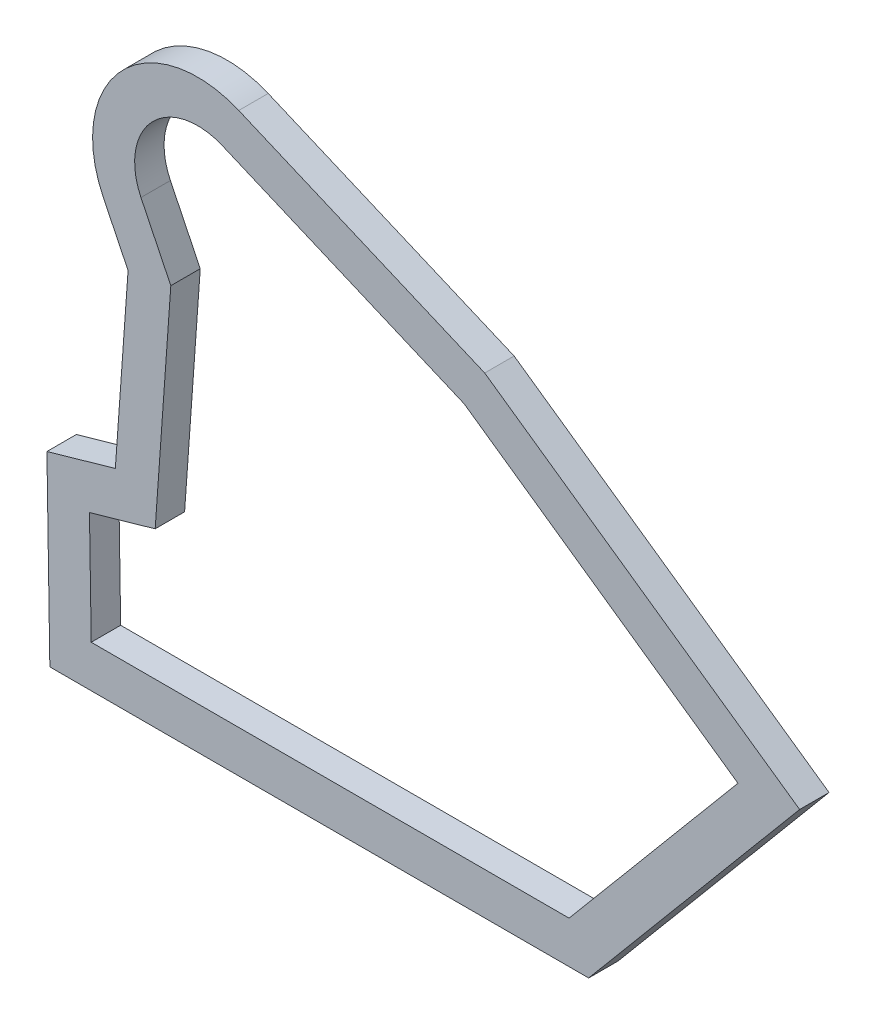
ISO-10303-21;
HEADER;
FILE_DESCRIPTION(('STEP AP214'),'2;1');
FILE_NAME('part.step','',(''),(''),'','','');
FILE_SCHEMA(('AUTOMOTIVE_DESIGN { 1 0 10303 214 1 1 1 1 }'));
ENDSEC;
DATA;
#1=APPLICATION_CONTEXT('core data for automotive mechanical design processes');
#2=APPLICATION_PROTOCOL_DEFINITION('international standard','automotive_design',2000,#1);
#3=PRODUCT_CONTEXT('',#1,'mechanical');
#4=PRODUCT('Part','Part','',(#3));
#5=PRODUCT_RELATED_PRODUCT_CATEGORY('part','',(#4));
#6=PRODUCT_DEFINITION_FORMATION('','',#4);
#7=PRODUCT_DEFINITION_CONTEXT('part definition',#1,'design');
#8=PRODUCT_DEFINITION('design','',#6,#7);
#9=PRODUCT_DEFINITION_SHAPE('','',#8);
#10=(LENGTH_UNIT() NAMED_UNIT(*) SI_UNIT(.MILLI.,.METRE.));
#11=(NAMED_UNIT(*) PLANE_ANGLE_UNIT() SI_UNIT($,.RADIAN.));
#12=(NAMED_UNIT(*) SI_UNIT($,.STERADIAN.) SOLID_ANGLE_UNIT());
#13=UNCERTAINTY_MEASURE_WITH_UNIT(LENGTH_MEASURE(1.E-05),#10,'distance_accuracy_value','');
#14=(GEOMETRIC_REPRESENTATION_CONTEXT(3) GLOBAL_UNCERTAINTY_ASSIGNED_CONTEXT((#13)) GLOBAL_UNIT_ASSIGNED_CONTEXT((#10,
#11,#12)) REPRESENTATION_CONTEXT('',''));
#15=CARTESIAN_POINT('',(0.,0.,0.));
#16=DIRECTION('',(0.,0.,1.));
#17=DIRECTION('',(1.,0.,0.));
#18=AXIS2_PLACEMENT_3D('',#15,#16,#17);
#19=CARTESIAN_POINT('',(18.1303757080204,56.6360908454548,2.8));
#20=DIRECTION('',(0.,0.,1.));
#21=DIRECTION('',(1.,0.,0.));
#22=AXIS2_PLACEMENT_3D('',#19,#20,#21);
#23=PLANE('',#22);
#24=CARTESIAN_POINT('',(18.1303757080204,56.6360908454548,2.8));
#25=DIRECTION('',(0.,0.,1.));
#26=DIRECTION('',(1.,0.,0.));
#27=AXIS2_PLACEMENT_3D('',#24,#25,#26);
#28=CIRCLE('',#27,10.);
#29=CARTESIAN_POINT('',(22.0376869929131,65.8411393799792,2.8));
#30=VERTEX_POINT('',#29);
#31=CARTESIAN_POINT('',(9.13500430810876,52.2676479446431,2.8));
#32=VERTEX_POINT('',#31);
#33=EDGE_CURVE('E266',#30,#32,#28,.T.);
#34=ORIENTED_EDGE('',*,*,#33,.T.);
#35=DIRECTION('',(0.436844290081168,-0.899537139991163,0.));
#36=VECTOR('',#35,1.);
#37=CARTESIAN_POINT('',(11.5062838946548,47.3847775355903,2.8));
#38=LINE('',#37,#36);
#39=CARTESIAN_POINT('',(11.5062838946548,47.3847775355903,2.8));
#40=VERTEX_POINT('',#39);
#41=EDGE_CURVE('E270',#32,#40,#38,.T.);
#42=ORIENTED_EDGE('',*,*,#41,.T.);
#43=DIRECTION('',(-0.0714503172871127,-0.99744415992053,0.));
#44=VECTOR('',#43,1.);
#45=CARTESIAN_POINT('',(10.2944473934542,30.4675784692252,2.8));
#46=LINE('',#45,#44);
#47=CARTESIAN_POINT('',(10.2944473934542,30.4675784692252,2.8));
#48=VERTEX_POINT('',#47);
#49=EDGE_CURVE('E274',#40,#48,#46,.T.);
#50=ORIENTED_EDGE('',*,*,#49,.T.);
#51=DIRECTION('',(-0.961728364482525,-0.274004658627856,0.));
#52=VECTOR('',#51,1.);
#53=CARTESIAN_POINT('',(3.7850103097116,28.6129840204588,2.8));
#54=LINE('',#53,#52);
#55=CARTESIAN_POINT('',(3.7850103097116,28.6129840204588,2.8));
#56=VERTEX_POINT('',#55);
#57=EDGE_CURVE('E277',#48,#56,#54,.T.);
#58=ORIENTED_EDGE('',*,*,#57,.T.);
#59=DIRECTION('',(0.0157545593487914,-0.999875889228121,0.));
#60=VECTOR('',#59,1.);
#61=CARTESIAN_POINT('',(4.06252955489897,11.,2.8));
#62=LINE('',#61,#60);
#63=CARTESIAN_POINT('',(4.06252955489897,11.,2.8));
#64=VERTEX_POINT('',#63);
#65=EDGE_CURVE('E280',#56,#64,#62,.T.);
#66=ORIENTED_EDGE('',*,*,#65,.T.);
#67=DIRECTION('',(1.,0.,0.));
#68=VECTOR('',#67,1.);
#69=CARTESIAN_POINT('',(55.3319592141137,11.,2.8));
#70=LINE('',#69,#68);
#71=CARTESIAN_POINT('',(55.3319592141137,11.,2.8));
#72=VERTEX_POINT('',#71);
#73=EDGE_CURVE('E283',#64,#72,#70,.T.);
#74=ORIENTED_EDGE('',*,*,#73,.T.);
#75=DIRECTION('',(0.642787609686537,0.76604444311898,0.));
#76=VECTOR('',#75,1.);
#77=CARTESIAN_POINT('',(75.4065149274647,34.9239238911188,2.8));
#78=LINE('',#77,#76);
#79=CARTESIAN_POINT('',(75.4065149274647,34.9239238911188,2.8));
#80=VERTEX_POINT('',#79);
#81=EDGE_CURVE('E286',#72,#80,#78,.T.);
#82=ORIENTED_EDGE('',*,*,#81,.T.);
#83=DIRECTION('',(-0.819152044288996,0.573576436351041,0.));
#84=VECTOR('',#83,1.);
#85=CARTESIAN_POINT('',(45.437304163946,55.9085911819299,2.8));
#86=LINE('',#85,#84);
#87=CARTESIAN_POINT('',(45.437304163946,55.9085911819299,2.8));
#88=VERTEX_POINT('',#87);
#89=EDGE_CURVE('E289',#80,#88,#86,.T.);
#90=ORIENTED_EDGE('',*,*,#89,.T.);
#91=DIRECTION('',(-0.92050485345244,0.390731128489274,0.));
#92=VECTOR('',#91,1.);
#93=CARTESIAN_POINT('',(22.0376869929131,65.8411393799792,2.8));
#94=LINE('',#93,#92);
#95=EDGE_CURVE('E292',#88,#30,#94,.T.);
#96=ORIENTED_EDGE('',*,*,#95,.T.);
#97=EDGE_LOOP('',(#34,#42,#50,#58,#66,#74,#82,#90,#96));
#98=FACE_BOUND('',#97,.T.);
#99=CARTESIAN_POINT('',(18.1303757080204,56.6360908454548,2.8));
#100=DIRECTION('',(0.,0.,1.));
#101=DIRECTION('',(1.,0.,0.));
#102=AXIS2_PLACEMENT_3D('',#99,#100,#101);
#103=CIRCLE('',#102,5.99999999999999);
#104=CARTESIAN_POINT('',(20.474762478956,62.1591199661694,2.8));
#105=VERTEX_POINT('',#104);
#106=CARTESIAN_POINT('',(12.7331528680734,54.0150251049678,2.8));
#107=VERTEX_POINT('',#106);
#108=EDGE_CURVE('E176',#105,#107,#103,.T.);
#109=ORIENTED_EDGE('',*,*,#108,.F.);
#110=DIRECTION('',(-0.92050485345244,0.390731128489273,0.));
#111=VECTOR('',#110,1.);
#112=CARTESIAN_POINT('',(43.487383815267,52.3908417539376,2.8));
#113=LINE('',#112,#111);
#114=CARTESIAN_POINT('',(43.487383815267,52.3908417539376,2.8));
#115=VERTEX_POINT('',#114);
#116=EDGE_CURVE('E167',#115,#105,#113,.T.);
#117=ORIENTED_EDGE('',*,*,#116,.F.);
#118=DIRECTION('',(-0.819152044288995,0.573576436351041,0.));
#119=VECTOR('',#118,1.);
#120=CARTESIAN_POINT('',(43.487383815267,52.3908417539376,2.8));
#121=LINE('',#120,#119);
#122=CARTESIAN_POINT('',(69.5364188236571,34.1511110779745,2.8));
#123=VERTEX_POINT('',#122);
#124=EDGE_CURVE('E211',#123,#115,#121,.T.);
#125=ORIENTED_EDGE('',*,*,#124,.F.);
#126=DIRECTION('',(0.642787609686537,0.76604444311898,0.));
#127=VECTOR('',#126,1.);
#128=CARTESIAN_POINT('',(69.5364188236571,34.1511110779745,2.8));
#129=LINE('',#128,#127);
#130=CARTESIAN_POINT('',(53.4667285814937,15.,2.8));
#131=VERTEX_POINT('',#130);
#132=EDGE_CURVE('E208',#131,#123,#129,.T.);
#133=ORIENTED_EDGE('',*,*,#132,.F.);
#134=DIRECTION('',(1.,0.,0.));
#135=VECTOR('',#134,1.);
#136=CARTESIAN_POINT('',(53.4667285814937,15.,2.8));
#137=LINE('',#136,#135);
#138=CARTESIAN_POINT('',(8.,15.,2.8));
#139=VERTEX_POINT('',#138);
#140=EDGE_CURVE('E205',#139,#131,#137,.T.);
#141=ORIENTED_EDGE('',*,*,#140,.F.);
#142=DIRECTION('',(0.0157545593487913,-0.999875889228121,0.));
#143=VECTOR('',#142,1.);
#144=CARTESIAN_POINT('',(8.,15.,2.8));
#145=LINE('',#144,#143);
#146=CARTESIAN_POINT('',(7.83286946091226,25.6070752401172,2.8));
#147=VERTEX_POINT('',#146);
#148=EDGE_CURVE('E202',#147,#139,#145,.T.);
#149=ORIENTED_EDGE('',*,*,#148,.F.);
#150=DIRECTION('',(-0.961728364482525,-0.274004658627856,0.));
#151=VECTOR('',#150,1.);
#152=CARTESIAN_POINT('',(7.83286946091226,25.6070752401172,2.8));
#153=LINE('',#152,#151);
#154=CARTESIAN_POINT('',(14.0841038300487,27.3881055211983,2.8));
#155=VERTEX_POINT('',#154);
#156=EDGE_CURVE('E199',#155,#147,#153,.T.);
#157=ORIENTED_EDGE('',*,*,#156,.F.);
#158=DIRECTION('',(-0.0714503172871127,-0.99744415992053,0.));
#159=VECTOR('',#158,1.);
#160=CARTESIAN_POINT('',(14.0841038300487,27.3881055211983,2.8));
#161=LINE('',#160,#159);
#162=CARTESIAN_POINT('',(15.572640753601,48.1680336950252,2.8));
#163=VERTEX_POINT('',#162);
#164=EDGE_CURVE('E194',#163,#155,#161,.T.);
#165=ORIENTED_EDGE('',*,*,#164,.F.);
#166=DIRECTION('',(0.436844290081168,-0.899537139991162,0.));
#167=VECTOR('',#166,1.);
#168=CARTESIAN_POINT('',(15.572640753601,48.1680336950252,2.8));
#169=LINE('',#168,#167);
#170=EDGE_CURVE('E190',#107,#163,#169,.T.);
#171=ORIENTED_EDGE('',*,*,#170,.F.);
#172=EDGE_LOOP('',(#109,#117,#125,#133,#141,#149,#157,#165,#171));
#173=FACE_BOUND('',#172,.T.);
#174=ADVANCED_FACE('F41',(#98,#173),#23,.T.);
#175=CARTESIAN_POINT('',(18.1303757080204,56.6360908454548,0.));
#176=DIRECTION('',(0.,0.,1.));
#177=DIRECTION('',(1.,0.,0.));
#178=AXIS2_PLACEMENT_3D('',#175,#176,#177);
#179=PLANE('',#178);
#180=CARTESIAN_POINT('',(18.1303757080204,56.6360908454548,0.));
#181=DIRECTION('',(0.,0.,1.));
#182=DIRECTION('',(1.,0.,0.));
#183=AXIS2_PLACEMENT_3D('',#180,#181,#182);
#184=CIRCLE('',#183,10.);
#185=CARTESIAN_POINT('',(22.0376869929131,65.8411393799792,0.));
#186=VERTEX_POINT('',#185);
#187=CARTESIAN_POINT('',(9.13500430810876,52.2676479446431,0.));
#188=VERTEX_POINT('',#187);
#189=EDGE_CURVE('E185',#186,#188,#184,.T.);
#190=ORIENTED_EDGE('',*,*,#189,.F.);
#191=DIRECTION('',(-0.92050485345244,0.390731128489274,0.));
#192=VECTOR('',#191,1.);
#193=CARTESIAN_POINT('',(22.0376869929131,65.8411393799792,0.));
#194=LINE('',#193,#192);
#195=CARTESIAN_POINT('',(45.437304163946,55.9085911819299,0.));
#196=VERTEX_POINT('',#195);
#197=EDGE_CURVE('E271',#196,#186,#194,.T.);
#198=ORIENTED_EDGE('',*,*,#197,.F.);
#199=DIRECTION('',(-0.819152044288996,0.573576436351041,0.));
#200=VECTOR('',#199,1.);
#201=CARTESIAN_POINT('',(45.437304163946,55.9085911819299,0.));
#202=LINE('',#201,#200);
#203=CARTESIAN_POINT('',(75.4065149274647,34.9239238911188,0.));
#204=VERTEX_POINT('',#203);
#205=EDGE_CURVE('E317',#204,#196,#202,.T.);
#206=ORIENTED_EDGE('',*,*,#205,.F.);
#207=DIRECTION('',(0.642787609686537,0.76604444311898,0.));
#208=VECTOR('',#207,1.);
#209=CARTESIAN_POINT('',(75.4065149274647,34.9239238911188,0.));
#210=LINE('',#209,#208);
#211=CARTESIAN_POINT('',(55.3319592141137,11.,0.));
#212=VERTEX_POINT('',#211);
#213=EDGE_CURVE('E314',#212,#204,#210,.T.);
#214=ORIENTED_EDGE('',*,*,#213,.F.);
#215=DIRECTION('',(1.,0.,0.));
#216=VECTOR('',#215,1.);
#217=CARTESIAN_POINT('',(55.3319592141137,11.,0.));
#218=LINE('',#217,#216);
#219=CARTESIAN_POINT('',(4.06252955489897,11.,0.));
#220=VERTEX_POINT('',#219);
#221=EDGE_CURVE('E311',#220,#212,#218,.T.);
#222=ORIENTED_EDGE('',*,*,#221,.F.);
#223=DIRECTION('',(0.0157545593487914,-0.999875889228121,0.));
#224=VECTOR('',#223,1.);
#225=CARTESIAN_POINT('',(4.06252955489897,11.,0.));
#226=LINE('',#225,#224);
#227=CARTESIAN_POINT('',(3.7850103097116,28.6129840204588,0.));
#228=VERTEX_POINT('',#227);
#229=EDGE_CURVE('E308',#228,#220,#226,.T.);
#230=ORIENTED_EDGE('',*,*,#229,.F.);
#231=DIRECTION('',(-0.961728364482525,-0.274004658627856,0.));
#232=VECTOR('',#231,1.);
#233=CARTESIAN_POINT('',(3.7850103097116,28.6129840204588,0.));
#234=LINE('',#233,#232);
#235=CARTESIAN_POINT('',(10.2944473934542,30.4675784692252,0.));
#236=VERTEX_POINT('',#235);
#237=EDGE_CURVE('E305',#236,#228,#234,.T.);
#238=ORIENTED_EDGE('',*,*,#237,.F.);
#239=DIRECTION('',(-0.0714503172871127,-0.99744415992053,0.));
#240=VECTOR('',#239,1.);
#241=CARTESIAN_POINT('',(10.2944473934542,30.4675784692252,0.));
#242=LINE('',#241,#240);
#243=CARTESIAN_POINT('',(11.5062838946548,47.3847775355903,0.));
#244=VERTEX_POINT('',#243);
#245=EDGE_CURVE('E302',#244,#236,#242,.T.);
#246=ORIENTED_EDGE('',*,*,#245,.F.);
#247=DIRECTION('',(0.436844290081168,-0.899537139991163,0.));
#248=VECTOR('',#247,1.);
#249=CARTESIAN_POINT('',(11.5062838946548,47.3847775355903,0.));
#250=LINE('',#249,#248);
#251=EDGE_CURVE('E299',#188,#244,#250,.T.);
#252=ORIENTED_EDGE('',*,*,#251,.F.);
#253=EDGE_LOOP('',(#190,#198,#206,#214,#222,#230,#238,#246,#252));
#254=FACE_BOUND('',#253,.T.);
#255=DIRECTION('',(-0.92050485345244,0.390731128489273,0.));
#256=VECTOR('',#255,1.);
#257=CARTESIAN_POINT('',(43.487383815267,52.3908417539376,0.));
#258=LINE('',#257,#256);
#259=CARTESIAN_POINT('',(43.487383815267,52.3908417539376,0.));
#260=VERTEX_POINT('',#259);
#261=CARTESIAN_POINT('',(20.474762478956,62.1591199661694,0.));
#262=VERTEX_POINT('',#261);
#263=EDGE_CURVE('E65',#260,#262,#258,.T.);
#264=ORIENTED_EDGE('',*,*,#263,.T.);
#265=CARTESIAN_POINT('',(18.1303757080204,56.6360908454548,0.));
#266=DIRECTION('',(0.,0.,1.));
#267=DIRECTION('',(1.,0.,0.));
#268=AXIS2_PLACEMENT_3D('',#265,#266,#267);
#269=CIRCLE('',#268,5.99999999999999);
#270=CARTESIAN_POINT('',(12.7331528680734,54.0150251049678,0.));
#271=VERTEX_POINT('',#270);
#272=EDGE_CURVE('E183',#262,#271,#269,.T.);
#273=ORIENTED_EDGE('',*,*,#272,.T.);
#274=DIRECTION('',(0.436844290081168,-0.899537139991162,0.));
#275=VECTOR('',#274,1.);
#276=CARTESIAN_POINT('',(15.572640753601,48.1680336950252,0.));
#277=LINE('',#276,#275);
#278=CARTESIAN_POINT('',(15.572640753601,48.1680336950252,0.));
#279=VERTEX_POINT('',#278);
#280=EDGE_CURVE('E218',#271,#279,#277,.T.);
#281=ORIENTED_EDGE('',*,*,#280,.T.);
#282=DIRECTION('',(-0.0714503172871127,-0.99744415992053,0.));
#283=VECTOR('',#282,1.);
#284=CARTESIAN_POINT('',(14.0841038300487,27.3881055211983,0.));
#285=LINE('',#284,#283);
#286=CARTESIAN_POINT('',(14.0841038300487,27.3881055211983,0.));
#287=VERTEX_POINT('',#286);
#288=EDGE_CURVE('E222',#279,#287,#285,.T.);
#289=ORIENTED_EDGE('',*,*,#288,.T.);
#290=DIRECTION('',(-0.961728364482525,-0.274004658627856,0.));
#291=VECTOR('',#290,1.);
#292=CARTESIAN_POINT('',(7.83286946091226,25.6070752401172,0.));
#293=LINE('',#292,#291);
#294=CARTESIAN_POINT('',(7.83286946091226,25.6070752401172,0.));
#295=VERTEX_POINT('',#294);
#296=EDGE_CURVE('E226',#287,#295,#293,.T.);
#297=ORIENTED_EDGE('',*,*,#296,.T.);
#298=DIRECTION('',(0.0157545593487913,-0.999875889228121,0.));
#299=VECTOR('',#298,1.);
#300=CARTESIAN_POINT('',(8.,15.,0.));
#301=LINE('',#300,#299);
#302=CARTESIAN_POINT('',(8.,15.,0.));
#303=VERTEX_POINT('',#302);
#304=EDGE_CURVE('E230',#295,#303,#301,.T.);
#305=ORIENTED_EDGE('',*,*,#304,.T.);
#306=DIRECTION('',(1.,0.,0.));
#307=VECTOR('',#306,1.);
#308=CARTESIAN_POINT('',(53.4667285814937,15.,0.));
#309=LINE('',#308,#307);
#310=CARTESIAN_POINT('',(53.4667285814937,15.,0.));
#311=VERTEX_POINT('',#310);
#312=EDGE_CURVE('E234',#303,#311,#309,.T.);
#313=ORIENTED_EDGE('',*,*,#312,.T.);
#314=DIRECTION('',(0.642787609686537,0.76604444311898,0.));
#315=VECTOR('',#314,1.);
#316=CARTESIAN_POINT('',(69.5364188236571,34.1511110779745,0.));
#317=LINE('',#316,#315);
#318=CARTESIAN_POINT('',(69.5364188236571,34.1511110779745,0.));
#319=VERTEX_POINT('',#318);
#320=EDGE_CURVE('E238',#311,#319,#317,.T.);
#321=ORIENTED_EDGE('',*,*,#320,.T.);
#322=DIRECTION('',(-0.819152044288995,0.573576436351041,0.));
#323=VECTOR('',#322,1.);
#324=CARTESIAN_POINT('',(43.487383815267,52.3908417539376,0.));
#325=LINE('',#324,#323);
#326=EDGE_CURVE('E177',#319,#260,#325,.T.);
#327=ORIENTED_EDGE('',*,*,#326,.T.);
#328=EDGE_LOOP('',(#264,#273,#281,#289,#297,#305,#313,#321,#327));
#329=FACE_BOUND('',#328,.T.);
#330=ADVANCED_FACE('F360',(#254,#329),#179,.F.);
#331=CARTESIAN_POINT('',(18.1303757080204,56.6360908454548,2.8));
#332=DIRECTION('',(0.,0.,-1.));
#333=DIRECTION('',(-1.,0.,0.));
#334=AXIS2_PLACEMENT_3D('',#331,#332,#333);
#335=CYLINDRICAL_SURFACE('',#334,10.);
#336=ORIENTED_EDGE('',*,*,#189,.T.);
#337=DIRECTION('',(0.,0.,-1.));
#338=VECTOR('',#337,1.);
#339=CARTESIAN_POINT('',(9.13500430810876,52.2676479446431,2.8));
#340=LINE('',#339,#338);
#341=EDGE_CURVE('E11',#32,#188,#340,.T.);
#342=ORIENTED_EDGE('',*,*,#341,.F.);
#343=ORIENTED_EDGE('',*,*,#33,.F.);
#344=DIRECTION('',(0.,0.,-1.));
#345=VECTOR('',#344,1.);
#346=CARTESIAN_POINT('',(22.0376869929131,65.8411393799792,2.8));
#347=LINE('',#346,#345);
#348=EDGE_CURVE('E295',#30,#186,#347,.T.);
#349=ORIENTED_EDGE('',*,*,#348,.T.);
#350=EDGE_LOOP('',(#336,#342,#343,#349));
#351=FACE_BOUND('',#350,.T.);
#352=ADVANCED_FACE('F43',(#351),#335,.T.);
#353=CARTESIAN_POINT('',(11.5062838946548,47.3847775355903,2.8));
#354=DIRECTION('',(0.899537139991163,0.436844290081168,0.));
#355=DIRECTION('',(-0.436844290081168,0.899537139991163,0.));
#356=AXIS2_PLACEMENT_3D('',#353,#354,#355);
#357=PLANE('',#356);
#358=ORIENTED_EDGE('',*,*,#251,.T.);
#359=DIRECTION('',(0.,0.,-1.));
#360=VECTOR('',#359,1.);
#361=CARTESIAN_POINT('',(11.5062838946548,47.3847775355903,2.8));
#362=LINE('',#361,#360);
#363=EDGE_CURVE('E50',#40,#244,#362,.T.);
#364=ORIENTED_EDGE('',*,*,#363,.F.);
#365=ORIENTED_EDGE('',*,*,#41,.F.);
#366=ORIENTED_EDGE('',*,*,#341,.T.);
#367=EDGE_LOOP('',(#358,#364,#365,#366));
#368=FACE_BOUND('',#367,.T.);
#369=ADVANCED_FACE('F377',(#368),#357,.F.);
#370=CARTESIAN_POINT('',(10.2944473934542,30.4675784692252,2.8));
#371=DIRECTION('',(0.997444159920529,-0.0714503172871127,0.));
#372=DIRECTION('',(0.0714503172871127,0.99744415992053,0.));
#373=AXIS2_PLACEMENT_3D('',#370,#371,#372);
#374=PLANE('',#373);
#375=ORIENTED_EDGE('',*,*,#245,.T.);
#376=DIRECTION('',(0.,0.,-1.));
#377=VECTOR('',#376,1.);
#378=CARTESIAN_POINT('',(10.2944473934542,30.4675784692252,2.8));
#379=LINE('',#378,#377);
#380=EDGE_CURVE('E345',#48,#236,#379,.T.);
#381=ORIENTED_EDGE('',*,*,#380,.F.);
#382=ORIENTED_EDGE('',*,*,#49,.F.);
#383=ORIENTED_EDGE('',*,*,#363,.T.);
#384=EDGE_LOOP('',(#375,#381,#382,#383));
#385=FACE_BOUND('',#384,.T.);
#386=ADVANCED_FACE('F354',(#385),#374,.F.);
#387=CARTESIAN_POINT('',(3.7850103097116,28.6129840204588,2.8));
#388=DIRECTION('',(0.274004658627856,-0.961728364482525,0.));
#389=DIRECTION('',(0.961728364482525,0.274004658627856,0.));
#390=AXIS2_PLACEMENT_3D('',#387,#388,#389);
#391=PLANE('',#390);
#392=ORIENTED_EDGE('',*,*,#237,.T.);
#393=DIRECTION('',(0.,0.,-1.));
#394=VECTOR('',#393,1.);
#395=CARTESIAN_POINT('',(3.7850103097116,28.6129840204588,2.8));
#396=LINE('',#395,#394);
#397=EDGE_CURVE('E341',#56,#228,#396,.T.);
#398=ORIENTED_EDGE('',*,*,#397,.F.);
#399=ORIENTED_EDGE('',*,*,#57,.F.);
#400=ORIENTED_EDGE('',*,*,#380,.T.);
#401=EDGE_LOOP('',(#392,#398,#399,#400));
#402=FACE_BOUND('',#401,.T.);
#403=ADVANCED_FACE('F366',(#402),#391,.F.);
#404=CARTESIAN_POINT('',(4.06252955489897,11.,2.8));
#405=DIRECTION('',(0.999875889228121,0.0157545593487914,0.));
#406=DIRECTION('',(-0.0157545593487914,0.999875889228121,0.));
#407=AXIS2_PLACEMENT_3D('',#404,#405,#406);
#408=PLANE('',#407);
#409=ORIENTED_EDGE('',*,*,#229,.T.);
#410=DIRECTION('',(0.,0.,-1.));
#411=VECTOR('',#410,1.);
#412=CARTESIAN_POINT('',(4.06252955489897,11.,2.8));
#413=LINE('',#412,#411);
#414=EDGE_CURVE('E337',#64,#220,#413,.T.);
#415=ORIENTED_EDGE('',*,*,#414,.F.);
#416=ORIENTED_EDGE('',*,*,#65,.F.);
#417=ORIENTED_EDGE('',*,*,#397,.T.);
#418=EDGE_LOOP('',(#409,#415,#416,#417));
#419=FACE_BOUND('',#418,.T.);
#420=ADVANCED_FACE('F370',(#419),#408,.F.);
#421=CARTESIAN_POINT('',(55.3319592141137,11.,2.8));
#422=DIRECTION('',(0.,1.,0.));
#423=DIRECTION('',(-1.,0.,0.));
#424=AXIS2_PLACEMENT_3D('',#421,#422,#423);
#425=PLANE('',#424);
#426=ORIENTED_EDGE('',*,*,#221,.T.);
#427=DIRECTION('',(0.,0.,-1.));
#428=VECTOR('',#427,1.);
#429=CARTESIAN_POINT('',(55.3319592141137,11.,2.8));
#430=LINE('',#429,#428);
#431=EDGE_CURVE('E333',#72,#212,#430,.T.);
#432=ORIENTED_EDGE('',*,*,#431,.F.);
#433=ORIENTED_EDGE('',*,*,#73,.F.);
#434=ORIENTED_EDGE('',*,*,#414,.T.);
#435=EDGE_LOOP('',(#426,#432,#433,#434));
#436=FACE_BOUND('',#435,.T.);
#437=ADVANCED_FACE('F395',(#436),#425,.F.);
#438=CARTESIAN_POINT('',(75.4065149274647,34.9239238911188,2.8));
#439=DIRECTION('',(-0.76604444311898,0.642787609686537,0.));
#440=DIRECTION('',(-0.642787609686537,-0.76604444311898,0.));
#441=AXIS2_PLACEMENT_3D('',#438,#439,#440);
#442=PLANE('',#441);
#443=ORIENTED_EDGE('',*,*,#213,.T.);
#444=DIRECTION('',(0.,0.,-1.));
#445=VECTOR('',#444,1.);
#446=CARTESIAN_POINT('',(75.4065149274647,34.9239238911188,2.8));
#447=LINE('',#446,#445);
#448=EDGE_CURVE('E329',#80,#204,#447,.T.);
#449=ORIENTED_EDGE('',*,*,#448,.F.);
#450=ORIENTED_EDGE('',*,*,#81,.F.);
#451=ORIENTED_EDGE('',*,*,#431,.T.);
#452=EDGE_LOOP('',(#443,#449,#450,#451));
#453=FACE_BOUND('',#452,.T.);
#454=ADVANCED_FACE('F393',(#453),#442,.F.);
#455=CARTESIAN_POINT('',(45.437304163946,55.9085911819299,2.8));
#456=DIRECTION('',(-0.573576436351041,-0.819152044288996,0.));
#457=DIRECTION('',(0.819152044288996,-0.573576436351041,0.));
#458=AXIS2_PLACEMENT_3D('',#455,#456,#457);
#459=PLANE('',#458);
#460=ORIENTED_EDGE('',*,*,#205,.T.);
#461=DIRECTION('',(0.,0.,-1.));
#462=VECTOR('',#461,1.);
#463=CARTESIAN_POINT('',(45.437304163946,55.9085911819299,2.8));
#464=LINE('',#463,#462);
#465=EDGE_CURVE('E325',#88,#196,#464,.T.);
#466=ORIENTED_EDGE('',*,*,#465,.F.);
#467=ORIENTED_EDGE('',*,*,#89,.F.);
#468=ORIENTED_EDGE('',*,*,#448,.T.);
#469=EDGE_LOOP('',(#460,#466,#467,#468));
#470=FACE_BOUND('',#469,.T.);
#471=ADVANCED_FACE('F389',(#470),#459,.F.);
#472=CARTESIAN_POINT('',(22.0376869929131,65.8411393799792,2.8));
#473=DIRECTION('',(-0.390731128489274,-0.92050485345244,0.));
#474=DIRECTION('',(0.92050485345244,-0.390731128489274,0.));
#475=AXIS2_PLACEMENT_3D('',#472,#473,#474);
#476=PLANE('',#475);
#477=ORIENTED_EDGE('',*,*,#197,.T.);
#478=ORIENTED_EDGE('',*,*,#348,.F.);
#479=ORIENTED_EDGE('',*,*,#95,.F.);
#480=ORIENTED_EDGE('',*,*,#465,.T.);
#481=EDGE_LOOP('',(#477,#478,#479,#480));
#482=FACE_BOUND('',#481,.T.);
#483=ADVANCED_FACE('F384',(#482),#476,.F.);
#484=CARTESIAN_POINT('',(43.487383815267,52.3908417539376,2.8));
#485=DIRECTION('',(-0.390731128489273,-0.920504853452441,0.));
#486=DIRECTION('',(0.920504853452441,-0.390731128489273,0.));
#487=AXIS2_PLACEMENT_3D('',#484,#485,#486);
#488=PLANE('',#487);
#489=ORIENTED_EDGE('',*,*,#263,.F.);
#490=DIRECTION('',(0.,0.,-1.));
#491=VECTOR('',#490,1.);
#492=CARTESIAN_POINT('',(43.487383815267,52.3908417539376,2.8));
#493=LINE('',#492,#491);
#494=EDGE_CURVE('E171',#115,#260,#493,.T.);
#495=ORIENTED_EDGE('',*,*,#494,.F.);
#496=ORIENTED_EDGE('',*,*,#116,.T.);
#497=DIRECTION('',(0.,0.,-1.));
#498=VECTOR('',#497,1.);
#499=CARTESIAN_POINT('',(20.474762478956,62.1591199661694,2.8));
#500=LINE('',#499,#498);
#501=EDGE_CURVE('E170',#105,#262,#500,.T.);
#502=ORIENTED_EDGE('',*,*,#501,.T.);
#503=EDGE_LOOP('',(#489,#495,#496,#502));
#504=FACE_BOUND('',#503,.T.);
#505=ADVANCED_FACE('F169',(#504),#488,.T.);
#506=CARTESIAN_POINT('',(18.1303757080204,56.6360908454548,2.8));
#507=DIRECTION('',(0.,0.,-1.));
#508=DIRECTION('',(-1.,0.,0.));
#509=AXIS2_PLACEMENT_3D('',#506,#507,#508);
#510=CYLINDRICAL_SURFACE('',#509,5.99999999999999);
#511=ORIENTED_EDGE('',*,*,#272,.F.);
#512=ORIENTED_EDGE('',*,*,#501,.F.);
#513=ORIENTED_EDGE('',*,*,#108,.T.);
#514=DIRECTION('',(0.,0.,-1.));
#515=VECTOR('',#514,1.);
#516=CARTESIAN_POINT('',(12.7331528680734,54.0150251049678,2.8));
#517=LINE('',#516,#515);
#518=EDGE_CURVE('E186',#107,#271,#517,.T.);
#519=ORIENTED_EDGE('',*,*,#518,.T.);
#520=EDGE_LOOP('',(#511,#512,#513,#519));
#521=FACE_BOUND('',#520,.T.);
#522=ADVANCED_FACE('F180',(#521),#510,.F.);
#523=CARTESIAN_POINT('',(15.572640753601,48.1680336950252,2.8));
#524=DIRECTION('',(0.899537139991163,0.436844290081168,0.));
#525=DIRECTION('',(-0.436844290081168,0.899537139991163,0.));
#526=AXIS2_PLACEMENT_3D('',#523,#524,#525);
#527=PLANE('',#526);
#528=ORIENTED_EDGE('',*,*,#280,.F.);
#529=ORIENTED_EDGE('',*,*,#518,.F.);
#530=ORIENTED_EDGE('',*,*,#170,.T.);
#531=DIRECTION('',(0.,0.,-1.));
#532=VECTOR('',#531,1.);
#533=CARTESIAN_POINT('',(15.572640753601,48.1680336950252,2.8));
#534=LINE('',#533,#532);
#535=EDGE_CURVE('E261',#163,#279,#534,.T.);
#536=ORIENTED_EDGE('',*,*,#535,.T.);
#537=EDGE_LOOP('',(#528,#529,#530,#536));
#538=FACE_BOUND('',#537,.T.);
#539=ADVANCED_FACE('F435',(#538),#527,.T.);
#540=CARTESIAN_POINT('',(14.0841038300487,27.3881055211983,2.8));
#541=DIRECTION('',(0.997444159920529,-0.0714503172871127,0.));
#542=DIRECTION('',(0.0714503172871127,0.99744415992053,0.));
#543=AXIS2_PLACEMENT_3D('',#540,#541,#542);
#544=PLANE('',#543);
#545=ORIENTED_EDGE('',*,*,#288,.F.);
#546=ORIENTED_EDGE('',*,*,#535,.F.);
#547=ORIENTED_EDGE('',*,*,#164,.T.);
#548=DIRECTION('',(0.,0.,-1.));
#549=VECTOR('',#548,1.);
#550=CARTESIAN_POINT('',(14.0841038300487,27.3881055211983,2.8));
#551=LINE('',#550,#549);
#552=EDGE_CURVE('E258',#155,#287,#551,.T.);
#553=ORIENTED_EDGE('',*,*,#552,.T.);
#554=EDGE_LOOP('',(#545,#546,#547,#553));
#555=FACE_BOUND('',#554,.T.);
#556=ADVANCED_FACE('F441',(#555),#544,.T.);
#557=CARTESIAN_POINT('',(7.83286946091226,25.6070752401172,2.8));
#558=DIRECTION('',(0.274004658627856,-0.961728364482525,0.));
#559=DIRECTION('',(0.961728364482525,0.274004658627856,0.));
#560=AXIS2_PLACEMENT_3D('',#557,#558,#559);
#561=PLANE('',#560);
#562=ORIENTED_EDGE('',*,*,#296,.F.);
#563=ORIENTED_EDGE('',*,*,#552,.F.);
#564=ORIENTED_EDGE('',*,*,#156,.T.);
#565=DIRECTION('',(0.,0.,-1.));
#566=VECTOR('',#565,1.);
#567=CARTESIAN_POINT('',(7.83286946091226,25.6070752401172,2.8));
#568=LINE('',#567,#566);
#569=EDGE_CURVE('E255',#147,#295,#568,.T.);
#570=ORIENTED_EDGE('',*,*,#569,.T.);
#571=EDGE_LOOP('',(#562,#563,#564,#570));
#572=FACE_BOUND('',#571,.T.);
#573=ADVANCED_FACE('F449',(#572),#561,.T.);
#574=CARTESIAN_POINT('',(8.,15.,2.8));
#575=DIRECTION('',(0.999875889228121,0.0157545593487913,0.));
#576=DIRECTION('',(-0.0157545593487913,0.999875889228121,0.));
#577=AXIS2_PLACEMENT_3D('',#574,#575,#576);
#578=PLANE('',#577);
#579=ORIENTED_EDGE('',*,*,#304,.F.);
#580=ORIENTED_EDGE('',*,*,#569,.F.);
#581=ORIENTED_EDGE('',*,*,#148,.T.);
#582=DIRECTION('',(0.,0.,-1.));
#583=VECTOR('',#582,1.);
#584=CARTESIAN_POINT('',(8.,15.,2.8));
#585=LINE('',#584,#583);
#586=EDGE_CURVE('E252',#139,#303,#585,.T.);
#587=ORIENTED_EDGE('',*,*,#586,.T.);
#588=EDGE_LOOP('',(#579,#580,#581,#587));
#589=FACE_BOUND('',#588,.T.);
#590=ADVANCED_FACE('F457',(#589),#578,.T.);
#591=CARTESIAN_POINT('',(53.4667285814937,15.,2.8));
#592=DIRECTION('',(0.,1.,0.));
#593=DIRECTION('',(-1.,0.,0.));
#594=AXIS2_PLACEMENT_3D('',#591,#592,#593);
#595=PLANE('',#594);
#596=ORIENTED_EDGE('',*,*,#312,.F.);
#597=ORIENTED_EDGE('',*,*,#586,.F.);
#598=ORIENTED_EDGE('',*,*,#140,.T.);
#599=DIRECTION('',(0.,0.,-1.));
#600=VECTOR('',#599,1.);
#601=CARTESIAN_POINT('',(53.4667285814937,15.,2.8));
#602=LINE('',#601,#600);
#603=EDGE_CURVE('E249',#131,#311,#602,.T.);
#604=ORIENTED_EDGE('',*,*,#603,.T.);
#605=EDGE_LOOP('',(#596,#597,#598,#604));
#606=FACE_BOUND('',#605,.T.);
#607=ADVANCED_FACE('F465',(#606),#595,.T.);
#608=CARTESIAN_POINT('',(69.5364188236571,34.1511110779745,2.8));
#609=DIRECTION('',(-0.76604444311898,0.642787609686537,0.));
#610=DIRECTION('',(-0.642787609686537,-0.76604444311898,0.));
#611=AXIS2_PLACEMENT_3D('',#608,#609,#610);
#612=PLANE('',#611);
#613=ORIENTED_EDGE('',*,*,#320,.F.);
#614=ORIENTED_EDGE('',*,*,#603,.F.);
#615=ORIENTED_EDGE('',*,*,#132,.T.);
#616=DIRECTION('',(0.,0.,-1.));
#617=VECTOR('',#616,1.);
#618=CARTESIAN_POINT('',(69.5364188236571,34.1511110779745,2.8));
#619=LINE('',#618,#617);
#620=EDGE_CURVE('E57',#123,#319,#619,.T.);
#621=ORIENTED_EDGE('',*,*,#620,.T.);
#622=EDGE_LOOP('',(#613,#614,#615,#621));
#623=FACE_BOUND('',#622,.T.);
#624=ADVANCED_FACE('F473',(#623),#612,.T.);
#625=CARTESIAN_POINT('',(43.487383815267,52.3908417539376,2.8));
#626=DIRECTION('',(-0.573576436351041,-0.819152044288996,0.));
#627=DIRECTION('',(0.819152044288996,-0.573576436351041,0.));
#628=AXIS2_PLACEMENT_3D('',#625,#626,#627);
#629=PLANE('',#628);
#630=ORIENTED_EDGE('',*,*,#326,.F.);
#631=ORIENTED_EDGE('',*,*,#620,.F.);
#632=ORIENTED_EDGE('',*,*,#124,.T.);
#633=ORIENTED_EDGE('',*,*,#494,.T.);
#634=EDGE_LOOP('',(#630,#631,#632,#633));
#635=FACE_BOUND('',#634,.T.);
#636=ADVANCED_FACE('F481',(#635),#629,.T.);
#637=CLOSED_SHELL('',(#174,#330,#352,#369,#386,#403,#420,#437,#454,#471,#483,#505,#522,#539,
#556,#573,#590,#607,#624,#636));
#638=MANIFOLD_SOLID_BREP('B2',#637);
#639=ADVANCED_BREP_SHAPE_REPRESENTATION('',(#18,#638),#14);
#640=SHAPE_DEFINITION_REPRESENTATION(#9,#639);
ENDSEC;
END-ISO-10303-21;
